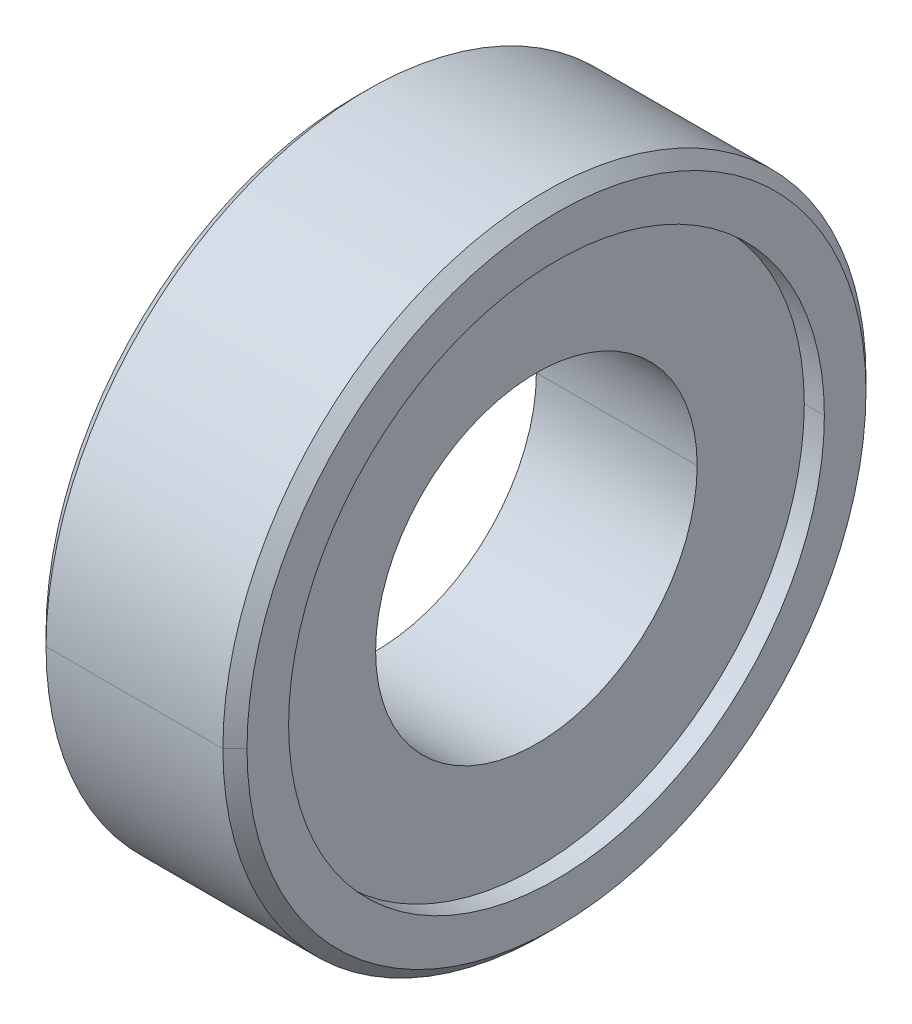
ISO-10303-21;
HEADER;
FILE_DESCRIPTION(('STEP AP214'),'2;1');
FILE_NAME('part.step','',(''),(''),'','','');
FILE_SCHEMA(('AUTOMOTIVE_DESIGN { 1 0 10303 214 1 1 1 1 }'));
ENDSEC;
DATA;
#1=APPLICATION_CONTEXT('core data for automotive mechanical design processes');
#2=APPLICATION_PROTOCOL_DEFINITION('international standard','automotive_design',2000,#1);
#3=PRODUCT_CONTEXT('',#1,'mechanical');
#4=PRODUCT('Part','Part','',(#3));
#5=PRODUCT_RELATED_PRODUCT_CATEGORY('part','',(#4));
#6=PRODUCT_DEFINITION_FORMATION('','',#4);
#7=PRODUCT_DEFINITION_CONTEXT('part definition',#1,'design');
#8=PRODUCT_DEFINITION('design','',#6,#7);
#9=PRODUCT_DEFINITION_SHAPE('','',#8);
#10=(LENGTH_UNIT() NAMED_UNIT(*) SI_UNIT(.MILLI.,.METRE.));
#11=(NAMED_UNIT(*) PLANE_ANGLE_UNIT() SI_UNIT($,.RADIAN.));
#12=(NAMED_UNIT(*) SI_UNIT($,.STERADIAN.) SOLID_ANGLE_UNIT());
#13=UNCERTAINTY_MEASURE_WITH_UNIT(LENGTH_MEASURE(1.E-05),#10,'distance_accuracy_value','');
#14=(GEOMETRIC_REPRESENTATION_CONTEXT(3) GLOBAL_UNCERTAINTY_ASSIGNED_CONTEXT((#13)) GLOBAL_UNIT_ASSIGNED_CONTEXT((#10,
#11,#12)) REPRESENTATION_CONTEXT('',''));
#15=CARTESIAN_POINT('',(0.,0.,0.));
#16=DIRECTION('',(0.,0.,1.));
#17=DIRECTION('',(1.,0.,0.));
#18=AXIS2_PLACEMENT_3D('',#15,#16,#17);
#19=CARTESIAN_POINT('',(-2.5,8.,0.));
#20=DIRECTION('',(-1.,0.,0.));
#21=DIRECTION('',(0.,0.,1.));
#22=AXIS2_PLACEMENT_3D('',#19,#20,#21);
#23=PLANE('',#22);
#24=CARTESIAN_POINT('',(-2.5,0.,0.));
#25=DIRECTION('',(1.,0.,0.));
#26=DIRECTION('',(0.,0.,-1.));
#27=AXIS2_PLACEMENT_3D('',#24,#25,#26);
#28=CIRCLE('',#27,6.665);
#29=CARTESIAN_POINT('',(-2.5,0.,-6.665));
#30=VERTEX_POINT('',#29);
#31=CARTESIAN_POINT('',(-2.5,0.,6.665));
#32=VERTEX_POINT('',#31);
#33=EDGE_CURVE('E11',#30,#32,#28,.T.);
#34=ORIENTED_EDGE('',*,*,#33,.T.);
#35=CARTESIAN_POINT('',(-2.5,0.,0.));
#36=DIRECTION('',(1.,0.,0.));
#37=DIRECTION('',(0.,0.,-1.));
#38=AXIS2_PLACEMENT_3D('',#35,#36,#37);
#39=CIRCLE('',#38,6.665);
#40=EDGE_CURVE('E25',#32,#30,#39,.T.);
#41=ORIENTED_EDGE('',*,*,#40,.T.);
#42=EDGE_LOOP('',(#34,#41));
#43=FACE_BOUND('',#42,.T.);
#44=CARTESIAN_POINT('',(-2.5,0.,0.));
#45=DIRECTION('',(1.,0.,0.));
#46=DIRECTION('',(0.,0.,-1.));
#47=AXIS2_PLACEMENT_3D('',#44,#45,#46);
#48=CIRCLE('',#47,7.7);
#49=CARTESIAN_POINT('',(-2.5,0.,7.7));
#50=VERTEX_POINT('',#49);
#51=CARTESIAN_POINT('',(-2.5,0.,-7.7));
#52=VERTEX_POINT('',#51);
#53=EDGE_CURVE('E230',#50,#52,#48,.T.);
#54=ORIENTED_EDGE('',*,*,#53,.F.);
#55=CARTESIAN_POINT('',(-2.5,0.,0.));
#56=DIRECTION('',(1.,0.,0.));
#57=DIRECTION('',(0.,0.,-1.));
#58=AXIS2_PLACEMENT_3D('',#55,#56,#57);
#59=CIRCLE('',#58,7.7);
#60=EDGE_CURVE('E225',#52,#50,#59,.T.);
#61=ORIENTED_EDGE('',*,*,#60,.F.);
#62=EDGE_LOOP('',(#54,#61));
#63=FACE_BOUND('',#62,.T.);
#64=ADVANCED_FACE('F17',(#43,#63),#23,.T.);
#65=CARTESIAN_POINT('',(-2.5,0.,0.));
#66=DIRECTION('',(1.,0.,0.));
#67=DIRECTION('',(0.,-1.,0.));
#68=AXIS2_PLACEMENT_3D('',#65,#66,#67);
#69=CONICAL_SURFACE('',#68,7.7,0.785398163397448);
#70=DIRECTION('',(0.707106781186548,0.,0.707106781186548));
#71=VECTOR('',#70,1.);
#72=CARTESIAN_POINT('',(-2.5,0.,7.7));
#73=LINE('',#72,#71);
#74=CARTESIAN_POINT('',(-2.2,0.,8.));
#75=VERTEX_POINT('',#74);
#76=EDGE_CURVE('E221',#50,#75,#73,.T.);
#77=ORIENTED_EDGE('',*,*,#76,.T.);
#78=CARTESIAN_POINT('',(-2.2,0.,0.));
#79=DIRECTION('',(1.,0.,0.));
#80=DIRECTION('',(0.,0.,-1.));
#81=AXIS2_PLACEMENT_3D('',#78,#79,#80);
#82=CIRCLE('',#81,8.);
#83=CARTESIAN_POINT('',(-2.2,0.,-8.));
#84=VERTEX_POINT('',#83);
#85=EDGE_CURVE('E216',#84,#75,#82,.T.);
#86=ORIENTED_EDGE('',*,*,#85,.F.);
#87=DIRECTION('',(0.707106781186548,0.,-0.707106781186548));
#88=VECTOR('',#87,1.);
#89=CARTESIAN_POINT('',(-2.5,0.,-7.7));
#90=LINE('',#89,#88);
#91=EDGE_CURVE('E211',#52,#84,#90,.T.);
#92=ORIENTED_EDGE('',*,*,#91,.F.);
#93=ORIENTED_EDGE('',*,*,#60,.T.);
#94=EDGE_LOOP('',(#77,#86,#92,#93));
#95=FACE_BOUND('',#94,.T.);
#96=ADVANCED_FACE('F246',(#95),#69,.T.);
#97=CARTESIAN_POINT('',(-2.5,0.,0.));
#98=DIRECTION('',(1.,0.,0.));
#99=DIRECTION('',(0.,1.,0.));
#100=AXIS2_PLACEMENT_3D('',#97,#98,#99);
#101=CONICAL_SURFACE('',#100,7.7,0.785398163397448);
#102=ORIENTED_EDGE('',*,*,#76,.F.);
#103=ORIENTED_EDGE('',*,*,#53,.T.);
#104=ORIENTED_EDGE('',*,*,#91,.T.);
#105=CARTESIAN_POINT('',(-2.2,0.,0.));
#106=DIRECTION('',(1.,0.,0.));
#107=DIRECTION('',(0.,0.,-1.));
#108=AXIS2_PLACEMENT_3D('',#105,#106,#107);
#109=CIRCLE('',#108,8.);
#110=EDGE_CURVE('E206',#75,#84,#109,.T.);
#111=ORIENTED_EDGE('',*,*,#110,.F.);
#112=EDGE_LOOP('',(#102,#103,#104,#111));
#113=FACE_BOUND('',#112,.T.);
#114=ADVANCED_FACE('F241',(#113),#101,.T.);
#115=CARTESIAN_POINT('',(2.5,0.,0.));
#116=DIRECTION('',(1.,0.,0.));
#117=DIRECTION('',(0.,1.,0.));
#118=AXIS2_PLACEMENT_3D('',#115,#116,#117);
#119=CYLINDRICAL_SURFACE('',#118,8.);
#120=DIRECTION('',(1.,0.,0.));
#121=VECTOR('',#120,1.);
#122=CARTESIAN_POINT('',(-2.2,0.,8.));
#123=LINE('',#122,#121);
#124=CARTESIAN_POINT('',(2.2,0.,8.));
#125=VERTEX_POINT('',#124);
#126=EDGE_CURVE('E201',#75,#125,#123,.T.);
#127=ORIENTED_EDGE('',*,*,#126,.F.);
#128=ORIENTED_EDGE('',*,*,#110,.T.);
#129=DIRECTION('',(1.,0.,0.));
#130=VECTOR('',#129,1.);
#131=CARTESIAN_POINT('',(-2.2,0.,-8.));
#132=LINE('',#131,#130);
#133=CARTESIAN_POINT('',(2.2,0.,-8.));
#134=VERTEX_POINT('',#133);
#135=EDGE_CURVE('E197',#84,#134,#132,.T.);
#136=ORIENTED_EDGE('',*,*,#135,.T.);
#137=CARTESIAN_POINT('',(2.2,0.,0.));
#138=DIRECTION('',(1.,0.,0.));
#139=DIRECTION('',(0.,0.,-1.));
#140=AXIS2_PLACEMENT_3D('',#137,#138,#139);
#141=CIRCLE('',#140,8.);
#142=EDGE_CURVE('E192',#125,#134,#141,.T.);
#143=ORIENTED_EDGE('',*,*,#142,.F.);
#144=EDGE_LOOP('',(#127,#128,#136,#143));
#145=FACE_BOUND('',#144,.T.);
#146=ADVANCED_FACE('F253',(#145),#119,.T.);
#147=CARTESIAN_POINT('',(2.2,0.,0.));
#148=DIRECTION('',(-1.,0.,0.));
#149=DIRECTION('',(0.,1.,0.));
#150=AXIS2_PLACEMENT_3D('',#147,#148,#149);
#151=CONICAL_SURFACE('',#150,8.,0.785398163397448);
#152=DIRECTION('',(-0.707106781186548,0.,-0.707106781186548));
#153=VECTOR('',#152,1.);
#154=CARTESIAN_POINT('',(2.5,0.,-7.7));
#155=LINE('',#154,#153);
#156=CARTESIAN_POINT('',(2.5,0.,-7.7));
#157=VERTEX_POINT('',#156);
#158=EDGE_CURVE('E187',#157,#134,#155,.T.);
#159=ORIENTED_EDGE('',*,*,#158,.F.);
#160=CARTESIAN_POINT('',(2.5,0.,0.));
#161=DIRECTION('',(1.,0.,0.));
#162=DIRECTION('',(0.,0.,-1.));
#163=AXIS2_PLACEMENT_3D('',#160,#161,#162);
#164=CIRCLE('',#163,7.7);
#165=CARTESIAN_POINT('',(2.5,0.,7.7));
#166=VERTEX_POINT('',#165);
#167=EDGE_CURVE('E182',#166,#157,#164,.T.);
#168=ORIENTED_EDGE('',*,*,#167,.F.);
#169=DIRECTION('',(-0.707106781186548,0.,0.707106781186548));
#170=VECTOR('',#169,1.);
#171=CARTESIAN_POINT('',(2.5,0.,7.7));
#172=LINE('',#171,#170);
#173=EDGE_CURVE('E177',#166,#125,#172,.T.);
#174=ORIENTED_EDGE('',*,*,#173,.T.);
#175=ORIENTED_EDGE('',*,*,#142,.T.);
#176=EDGE_LOOP('',(#159,#168,#174,#175));
#177=FACE_BOUND('',#176,.T.);
#178=ADVANCED_FACE('F255',(#177),#151,.T.);
#179=CARTESIAN_POINT('',(2.2,0.,0.));
#180=DIRECTION('',(-1.,0.,0.));
#181=DIRECTION('',(0.,-1.,0.));
#182=AXIS2_PLACEMENT_3D('',#179,#180,#181);
#183=CONICAL_SURFACE('',#182,8.,0.785398163397448);
#184=ORIENTED_EDGE('',*,*,#158,.T.);
#185=CARTESIAN_POINT('',(2.2,0.,0.));
#186=DIRECTION('',(1.,0.,0.));
#187=DIRECTION('',(0.,0.,-1.));
#188=AXIS2_PLACEMENT_3D('',#185,#186,#187);
#189=CIRCLE('',#188,8.);
#190=EDGE_CURVE('E172',#134,#125,#189,.T.);
#191=ORIENTED_EDGE('',*,*,#190,.T.);
#192=ORIENTED_EDGE('',*,*,#173,.F.);
#193=CARTESIAN_POINT('',(2.5,0.,0.));
#194=DIRECTION('',(1.,0.,0.));
#195=DIRECTION('',(0.,0.,-1.));
#196=AXIS2_PLACEMENT_3D('',#193,#194,#195);
#197=CIRCLE('',#196,7.7);
#198=EDGE_CURVE('E167',#157,#166,#197,.T.);
#199=ORIENTED_EDGE('',*,*,#198,.F.);
#200=EDGE_LOOP('',(#184,#191,#192,#199));
#201=FACE_BOUND('',#200,.T.);
#202=ADVANCED_FACE('F259',(#201),#183,.T.);
#203=CARTESIAN_POINT('',(2.5,6.665,0.));
#204=DIRECTION('',(1.,0.,0.));
#205=DIRECTION('',(0.,0.,-1.));
#206=AXIS2_PLACEMENT_3D('',#203,#204,#205);
#207=PLANE('',#206);
#208=ORIENTED_EDGE('',*,*,#198,.T.);
#209=ORIENTED_EDGE('',*,*,#167,.T.);
#210=EDGE_LOOP('',(#208,#209));
#211=FACE_BOUND('',#210,.T.);
#212=CARTESIAN_POINT('',(2.5,0.,0.));
#213=DIRECTION('',(1.,0.,0.));
#214=DIRECTION('',(0.,0.,-1.));
#215=AXIS2_PLACEMENT_3D('',#212,#213,#214);
#216=CIRCLE('',#215,6.665);
#217=CARTESIAN_POINT('',(2.5,0.,6.665));
#218=VERTEX_POINT('',#217);
#219=CARTESIAN_POINT('',(2.5,0.,-6.665));
#220=VERTEX_POINT('',#219);
#221=EDGE_CURVE('E162',#218,#220,#216,.T.);
#222=ORIENTED_EDGE('',*,*,#221,.F.);
#223=CARTESIAN_POINT('',(2.5,0.,0.));
#224=DIRECTION('',(1.,0.,0.));
#225=DIRECTION('',(0.,0.,-1.));
#226=AXIS2_PLACEMENT_3D('',#223,#224,#225);
#227=CIRCLE('',#226,6.665);
#228=EDGE_CURVE('E157',#220,#218,#227,.T.);
#229=ORIENTED_EDGE('',*,*,#228,.F.);
#230=EDGE_LOOP('',(#222,#229));
#231=FACE_BOUND('',#230,.T.);
#232=ADVANCED_FACE('F261',(#211,#231),#207,.T.);
#233=CARTESIAN_POINT('',(2.5,0.,0.));
#234=DIRECTION('',(1.,0.,0.));
#235=DIRECTION('',(0.,-1.,0.));
#236=AXIS2_PLACEMENT_3D('',#233,#234,#235);
#237=CYLINDRICAL_SURFACE('',#236,6.665);
#238=DIRECTION('',(1.,0.,0.));
#239=VECTOR('',#238,1.);
#240=CARTESIAN_POINT('',(2.,0.,6.665));
#241=LINE('',#240,#239);
#242=CARTESIAN_POINT('',(2.,0.,6.665));
#243=VERTEX_POINT('',#242);
#244=EDGE_CURVE('E152',#243,#218,#241,.T.);
#245=ORIENTED_EDGE('',*,*,#244,.F.);
#246=CARTESIAN_POINT('',(2.,0.,0.));
#247=DIRECTION('',(1.,0.,0.));
#248=DIRECTION('',(0.,0.,-1.));
#249=AXIS2_PLACEMENT_3D('',#246,#247,#248);
#250=CIRCLE('',#249,6.665);
#251=CARTESIAN_POINT('',(2.,0.,-6.665));
#252=VERTEX_POINT('',#251);
#253=EDGE_CURVE('E147',#252,#243,#250,.T.);
#254=ORIENTED_EDGE('',*,*,#253,.F.);
#255=DIRECTION('',(1.,0.,0.));
#256=VECTOR('',#255,1.);
#257=CARTESIAN_POINT('',(2.,0.,-6.665));
#258=LINE('',#257,#256);
#259=EDGE_CURVE('E142',#252,#220,#258,.T.);
#260=ORIENTED_EDGE('',*,*,#259,.T.);
#261=ORIENTED_EDGE('',*,*,#228,.T.);
#262=EDGE_LOOP('',(#245,#254,#260,#261));
#263=FACE_BOUND('',#262,.T.);
#264=ADVANCED_FACE('F264',(#263),#237,.F.);
#265=CARTESIAN_POINT('',(2.5,0.,0.));
#266=DIRECTION('',(1.,0.,0.));
#267=DIRECTION('',(0.,1.,0.));
#268=AXIS2_PLACEMENT_3D('',#265,#266,#267);
#269=CYLINDRICAL_SURFACE('',#268,6.665);
#270=ORIENTED_EDGE('',*,*,#244,.T.);
#271=ORIENTED_EDGE('',*,*,#221,.T.);
#272=ORIENTED_EDGE('',*,*,#259,.F.);
#273=CARTESIAN_POINT('',(2.,0.,0.));
#274=DIRECTION('',(1.,0.,0.));
#275=DIRECTION('',(0.,0.,-1.));
#276=AXIS2_PLACEMENT_3D('',#273,#274,#275);
#277=CIRCLE('',#276,6.665);
#278=EDGE_CURVE('E137',#243,#252,#277,.T.);
#279=ORIENTED_EDGE('',*,*,#278,.F.);
#280=EDGE_LOOP('',(#270,#271,#272,#279));
#281=FACE_BOUND('',#280,.T.);
#282=ADVANCED_FACE('F269',(#281),#269,.F.);
#283=CARTESIAN_POINT('',(2.,4.,0.));
#284=DIRECTION('',(1.,0.,0.));
#285=DIRECTION('',(0.,0.,-1.));
#286=AXIS2_PLACEMENT_3D('',#283,#284,#285);
#287=PLANE('',#286);
#288=ORIENTED_EDGE('',*,*,#253,.T.);
#289=ORIENTED_EDGE('',*,*,#278,.T.);
#290=EDGE_LOOP('',(#288,#289));
#291=FACE_BOUND('',#290,.T.);
#292=CARTESIAN_POINT('',(2.,0.,0.));
#293=DIRECTION('',(1.,0.,0.));
#294=DIRECTION('',(0.,0.,-1.));
#295=AXIS2_PLACEMENT_3D('',#292,#293,#294);
#296=CIRCLE('',#295,4.);
#297=CARTESIAN_POINT('',(2.,0.,4.));
#298=VERTEX_POINT('',#297);
#299=CARTESIAN_POINT('',(2.,0.,-4.));
#300=VERTEX_POINT('',#299);
#301=EDGE_CURVE('E132',#298,#300,#296,.T.);
#302=ORIENTED_EDGE('',*,*,#301,.F.);
#303=CARTESIAN_POINT('',(2.,0.,0.));
#304=DIRECTION('',(1.,0.,0.));
#305=DIRECTION('',(0.,0.,-1.));
#306=AXIS2_PLACEMENT_3D('',#303,#304,#305);
#307=CIRCLE('',#306,4.);
#308=EDGE_CURVE('E127',#300,#298,#307,.T.);
#309=ORIENTED_EDGE('',*,*,#308,.F.);
#310=EDGE_LOOP('',(#302,#309));
#311=FACE_BOUND('',#310,.T.);
#312=ADVANCED_FACE('F272',(#291,#311),#287,.T.);
#313=CARTESIAN_POINT('',(2.5,0.,0.));
#314=DIRECTION('',(1.,0.,0.));
#315=DIRECTION('',(0.,-1.,0.));
#316=AXIS2_PLACEMENT_3D('',#313,#314,#315);
#317=CYLINDRICAL_SURFACE('',#316,4.);
#318=DIRECTION('',(1.,0.,0.));
#319=VECTOR('',#318,1.);
#320=CARTESIAN_POINT('',(-2.,0.,4.));
#321=LINE('',#320,#319);
#322=CARTESIAN_POINT('',(-2.,0.,4.));
#323=VERTEX_POINT('',#322);
#324=EDGE_CURVE('E122',#323,#298,#321,.T.);
#325=ORIENTED_EDGE('',*,*,#324,.F.);
#326=CARTESIAN_POINT('',(-2.,0.,0.));
#327=DIRECTION('',(1.,0.,0.));
#328=DIRECTION('',(0.,0.,-1.));
#329=AXIS2_PLACEMENT_3D('',#326,#327,#328);
#330=CIRCLE('',#329,4.);
#331=CARTESIAN_POINT('',(-2.,0.,-4.));
#332=VERTEX_POINT('',#331);
#333=EDGE_CURVE('E117',#332,#323,#330,.T.);
#334=ORIENTED_EDGE('',*,*,#333,.F.);
#335=DIRECTION('',(1.,0.,0.));
#336=VECTOR('',#335,1.);
#337=CARTESIAN_POINT('',(-2.,0.,-4.));
#338=LINE('',#337,#336);
#339=EDGE_CURVE('E106',#332,#300,#338,.T.);
#340=ORIENTED_EDGE('',*,*,#339,.T.);
#341=ORIENTED_EDGE('',*,*,#308,.T.);
#342=EDGE_LOOP('',(#325,#334,#340,#341));
#343=FACE_BOUND('',#342,.T.);
#344=ADVANCED_FACE('F275',(#343),#317,.F.);
#345=CARTESIAN_POINT('',(2.5,0.,0.));
#346=DIRECTION('',(1.,0.,0.));
#347=DIRECTION('',(0.,1.,0.));
#348=AXIS2_PLACEMENT_3D('',#345,#346,#347);
#349=CYLINDRICAL_SURFACE('',#348,4.);
#350=ORIENTED_EDGE('',*,*,#324,.T.);
#351=ORIENTED_EDGE('',*,*,#301,.T.);
#352=ORIENTED_EDGE('',*,*,#339,.F.);
#353=CARTESIAN_POINT('',(-2.,0.,0.));
#354=DIRECTION('',(1.,0.,0.));
#355=DIRECTION('',(0.,0.,-1.));
#356=AXIS2_PLACEMENT_3D('',#353,#354,#355);
#357=CIRCLE('',#356,4.);
#358=EDGE_CURVE('E103',#323,#332,#357,.T.);
#359=ORIENTED_EDGE('',*,*,#358,.F.);
#360=EDGE_LOOP('',(#350,#351,#352,#359));
#361=FACE_BOUND('',#360,.T.);
#362=ADVANCED_FACE('F280',(#361),#349,.F.);
#363=CARTESIAN_POINT('',(-2.,6.665,0.));
#364=DIRECTION('',(-1.,0.,0.));
#365=DIRECTION('',(0.,0.,1.));
#366=AXIS2_PLACEMENT_3D('',#363,#364,#365);
#367=PLANE('',#366);
#368=ORIENTED_EDGE('',*,*,#333,.T.);
#369=ORIENTED_EDGE('',*,*,#358,.T.);
#370=EDGE_LOOP('',(#368,#369));
#371=FACE_BOUND('',#370,.T.);
#372=CARTESIAN_POINT('',(-2.,0.,0.));
#373=DIRECTION('',(1.,0.,0.));
#374=DIRECTION('',(0.,0.,-1.));
#375=AXIS2_PLACEMENT_3D('',#372,#373,#374);
#376=CIRCLE('',#375,6.665);
#377=CARTESIAN_POINT('',(-2.,0.,6.665));
#378=VERTEX_POINT('',#377);
#379=CARTESIAN_POINT('',(-2.,0.,-6.665));
#380=VERTEX_POINT('',#379);
#381=EDGE_CURVE('E91',#378,#380,#376,.T.);
#382=ORIENTED_EDGE('',*,*,#381,.F.);
#383=CARTESIAN_POINT('',(-2.,0.,0.));
#384=DIRECTION('',(1.,0.,0.));
#385=DIRECTION('',(0.,0.,-1.));
#386=AXIS2_PLACEMENT_3D('',#383,#384,#385);
#387=CIRCLE('',#386,6.665);
#388=EDGE_CURVE('E87',#380,#378,#387,.T.);
#389=ORIENTED_EDGE('',*,*,#388,.F.);
#390=EDGE_LOOP('',(#382,#389));
#391=FACE_BOUND('',#390,.T.);
#392=ADVANCED_FACE('F89',(#371,#391),#367,.T.);
#393=CARTESIAN_POINT('',(2.5,0.,0.));
#394=DIRECTION('',(1.,0.,0.));
#395=DIRECTION('',(0.,-1.,0.));
#396=AXIS2_PLACEMENT_3D('',#393,#394,#395);
#397=CYLINDRICAL_SURFACE('',#396,6.665);
#398=DIRECTION('',(1.,0.,0.));
#399=VECTOR('',#398,1.);
#400=CARTESIAN_POINT('',(-2.5,0.,6.665));
#401=LINE('',#400,#399);
#402=EDGE_CURVE('E95',#32,#378,#401,.T.);
#403=ORIENTED_EDGE('',*,*,#402,.F.);
#404=ORIENTED_EDGE('',*,*,#33,.F.);
#405=DIRECTION('',(1.,0.,0.));
#406=VECTOR('',#405,1.);
#407=CARTESIAN_POINT('',(-2.5,0.,-6.665));
#408=LINE('',#407,#406);
#409=EDGE_CURVE('E98',#30,#380,#408,.T.);
#410=ORIENTED_EDGE('',*,*,#409,.T.);
#411=ORIENTED_EDGE('',*,*,#388,.T.);
#412=EDGE_LOOP('',(#403,#404,#410,#411));
#413=FACE_BOUND('',#412,.T.);
#414=ADVANCED_FACE('F99',(#413),#397,.F.);
#415=CARTESIAN_POINT('',(2.5,0.,0.));
#416=DIRECTION('',(1.,0.,0.));
#417=DIRECTION('',(0.,1.,0.));
#418=AXIS2_PLACEMENT_3D('',#415,#416,#417);
#419=CYLINDRICAL_SURFACE('',#418,6.665);
#420=ORIENTED_EDGE('',*,*,#402,.T.);
#421=ORIENTED_EDGE('',*,*,#381,.T.);
#422=ORIENTED_EDGE('',*,*,#409,.F.);
#423=ORIENTED_EDGE('',*,*,#40,.F.);
#424=EDGE_LOOP('',(#420,#421,#422,#423));
#425=FACE_BOUND('',#424,.T.);
#426=ADVANCED_FACE('F102',(#425),#419,.F.);
#427=CARTESIAN_POINT('',(2.5,0.,0.));
#428=DIRECTION('',(1.,0.,0.));
#429=DIRECTION('',(0.,-1.,0.));
#430=AXIS2_PLACEMENT_3D('',#427,#428,#429);
#431=CYLINDRICAL_SURFACE('',#430,8.);
#432=ORIENTED_EDGE('',*,*,#126,.T.);
#433=ORIENTED_EDGE('',*,*,#190,.F.);
#434=ORIENTED_EDGE('',*,*,#135,.F.);
#435=ORIENTED_EDGE('',*,*,#85,.T.);
#436=EDGE_LOOP('',(#432,#433,#434,#435));
#437=FACE_BOUND('',#436,.T.);
#438=ADVANCED_FACE('F249',(#437),#431,.T.);
#439=CLOSED_SHELL('',(#64,#96,#114,#146,#178,#202,#232,#264,#282,#312,#344,#362,#392,#414,#426,#438));
#440=MANIFOLD_SOLID_BREP('B1',#439);
#441=ADVANCED_BREP_SHAPE_REPRESENTATION('',(#18,#440),#14);
#442=SHAPE_DEFINITION_REPRESENTATION(#9,#441);
ENDSEC;
END-ISO-10303-21;
